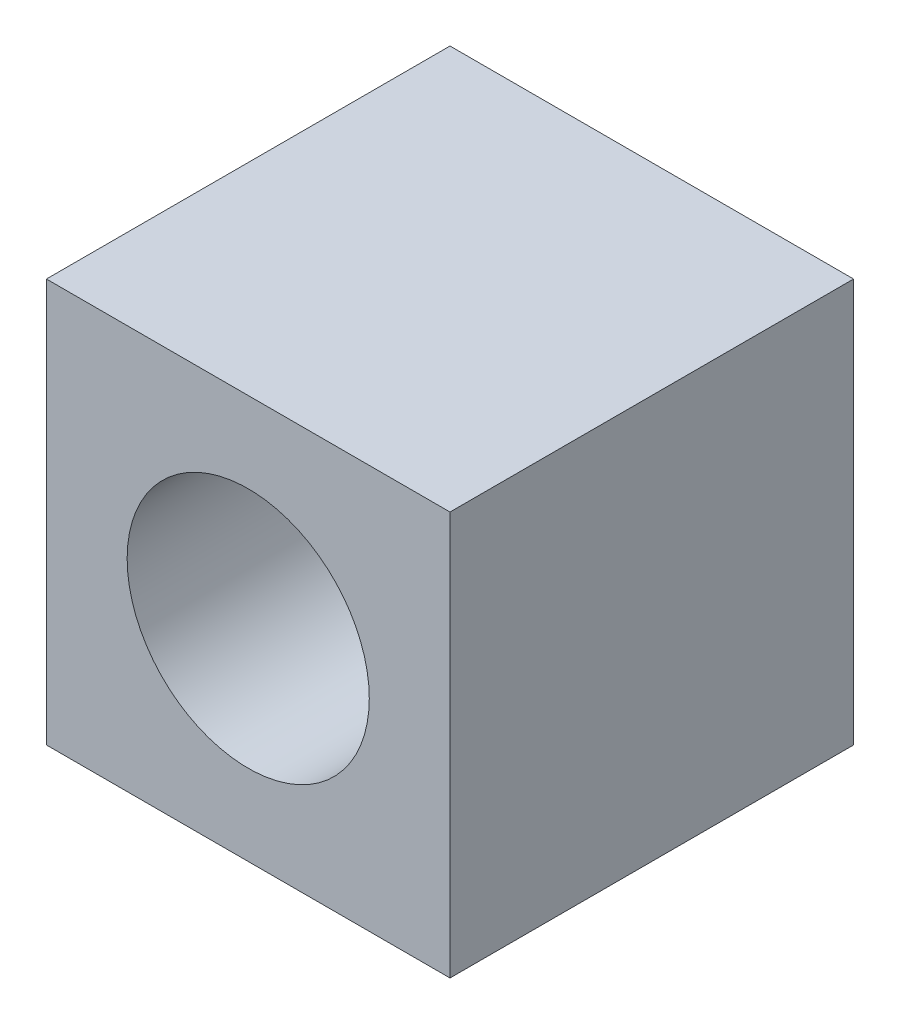
ISO-10303-21;
HEADER;
FILE_DESCRIPTION(('STEP AP214'),'2;1');
FILE_NAME('part.step','',(''),(''),'','','');
FILE_SCHEMA(('AUTOMOTIVE_DESIGN { 1 0 10303 214 1 1 1 1 }'));
ENDSEC;
DATA;
#1=APPLICATION_CONTEXT('core data for automotive mechanical design processes');
#2=APPLICATION_PROTOCOL_DEFINITION('international standard','automotive_design',2000,#1);
#3=PRODUCT_CONTEXT('',#1,'mechanical');
#4=PRODUCT('Part','Part','',(#3));
#5=PRODUCT_RELATED_PRODUCT_CATEGORY('part','',(#4));
#6=PRODUCT_DEFINITION_FORMATION('','',#4);
#7=PRODUCT_DEFINITION_CONTEXT('part definition',#1,'design');
#8=PRODUCT_DEFINITION('design','',#6,#7);
#9=PRODUCT_DEFINITION_SHAPE('','',#8);
#10=(LENGTH_UNIT() NAMED_UNIT(*) SI_UNIT(.MILLI.,.METRE.));
#11=(NAMED_UNIT(*) PLANE_ANGLE_UNIT() SI_UNIT($,.RADIAN.));
#12=(NAMED_UNIT(*) SI_UNIT($,.STERADIAN.) SOLID_ANGLE_UNIT());
#13=UNCERTAINTY_MEASURE_WITH_UNIT(LENGTH_MEASURE(1.E-05),#10,'distance_accuracy_value','');
#14=(GEOMETRIC_REPRESENTATION_CONTEXT(3) GLOBAL_UNCERTAINTY_ASSIGNED_CONTEXT((#13)) GLOBAL_UNIT_ASSIGNED_CONTEXT((#10,
#11,#12)) REPRESENTATION_CONTEXT('',''));
#15=CARTESIAN_POINT('',(0.,0.,0.));
#16=DIRECTION('',(0.,0.,1.));
#17=DIRECTION('',(1.,0.,0.));
#18=AXIS2_PLACEMENT_3D('',#15,#16,#17);
#19=CARTESIAN_POINT('',(0.,10.,0.));
#20=DIRECTION('',(0.,0.,-1.));
#21=DIRECTION('',(-1.,0.,0.));
#22=AXIS2_PLACEMENT_3D('',#19,#20,#21);
#23=PLANE('',#22);
#24=CARTESIAN_POINT('',(5.,5.,0.));
#25=DIRECTION('',(0.,0.,1.));
#26=DIRECTION('',(1.,0.,0.));
#27=AXIS2_PLACEMENT_3D('',#24,#25,#26);
#28=CIRCLE('',#27,3.);
#29=CARTESIAN_POINT('',(8.,5.,0.));
#30=VERTEX_POINT('',#29);
#31=EDGE_CURVE('E110',#30,#30,#28,.T.);
#32=ORIENTED_EDGE('',*,*,#31,.F.);
#33=EDGE_LOOP('',(#32));
#34=FACE_BOUND('',#33,.T.);
#35=DIRECTION('',(1.,0.,0.));
#36=VECTOR('',#35,1.);
#37=CARTESIAN_POINT('',(0.,0.,0.));
#38=LINE('',#37,#36);
#39=CARTESIAN_POINT('',(0.,0.,0.));
#40=VERTEX_POINT('',#39);
#41=CARTESIAN_POINT('',(10.,0.,0.));
#42=VERTEX_POINT('',#41);
#43=EDGE_CURVE('E96',#40,#42,#38,.T.);
#44=ORIENTED_EDGE('',*,*,#43,.T.);
#45=DIRECTION('',(0.,-1.,0.));
#46=VECTOR('',#45,1.);
#47=CARTESIAN_POINT('',(10.,10.,0.));
#48=LINE('',#47,#46);
#49=CARTESIAN_POINT('',(10.,10.,0.));
#50=VERTEX_POINT('',#49);
#51=EDGE_CURVE('E11',#50,#42,#48,.T.);
#52=ORIENTED_EDGE('',*,*,#51,.F.);
#53=DIRECTION('',(1.,0.,0.));
#54=VECTOR('',#53,1.);
#55=CARTESIAN_POINT('',(0.,10.,0.));
#56=LINE('',#55,#54);
#57=CARTESIAN_POINT('',(0.,10.,0.));
#58=VERTEX_POINT('',#57);
#59=EDGE_CURVE('E84',#58,#50,#56,.T.);
#60=ORIENTED_EDGE('',*,*,#59,.F.);
#61=DIRECTION('',(0.,-1.,0.));
#62=VECTOR('',#61,1.);
#63=CARTESIAN_POINT('',(0.,10.,0.));
#64=LINE('',#63,#62);
#65=EDGE_CURVE('E92',#58,#40,#64,.T.);
#66=ORIENTED_EDGE('',*,*,#65,.T.);
#67=EDGE_LOOP('',(#44,#52,#60,#66));
#68=FACE_BOUND('',#67,.T.);
#69=ADVANCED_FACE('F33',(#34,#68),#23,.F.);
#70=CARTESIAN_POINT('',(10.,10.,-10.));
#71=DIRECTION('',(-1.,0.,0.));
#72=DIRECTION('',(0.,0.,1.));
#73=AXIS2_PLACEMENT_3D('',#70,#71,#72);
#74=PLANE('',#73);
#75=DIRECTION('',(0.,0.,-1.));
#76=VECTOR('',#75,1.);
#77=CARTESIAN_POINT('',(10.,0.,-10.));
#78=LINE('',#77,#76);
#79=CARTESIAN_POINT('',(10.,0.,-10.));
#80=VERTEX_POINT('',#79);
#81=EDGE_CURVE('E88',#42,#80,#78,.T.);
#82=ORIENTED_EDGE('',*,*,#81,.T.);
#83=DIRECTION('',(0.,-1.,0.));
#84=VECTOR('',#83,1.);
#85=CARTESIAN_POINT('',(10.,10.,-10.));
#86=LINE('',#85,#84);
#87=CARTESIAN_POINT('',(10.,10.,-10.));
#88=VERTEX_POINT('',#87);
#89=EDGE_CURVE('E41',#88,#80,#86,.T.);
#90=ORIENTED_EDGE('',*,*,#89,.F.);
#91=DIRECTION('',(0.,0.,-1.));
#92=VECTOR('',#91,1.);
#93=CARTESIAN_POINT('',(10.,10.,-10.));
#94=LINE('',#93,#92);
#95=EDGE_CURVE('E79',#50,#88,#94,.T.);
#96=ORIENTED_EDGE('',*,*,#95,.F.);
#97=ORIENTED_EDGE('',*,*,#51,.T.);
#98=EDGE_LOOP('',(#82,#90,#96,#97));
#99=FACE_BOUND('',#98,.T.);
#100=ADVANCED_FACE('F87',(#99),#74,.F.);
#101=CARTESIAN_POINT('',(0.,10.,-10.));
#102=DIRECTION('',(0.,0.,1.));
#103=DIRECTION('',(1.,0.,0.));
#104=AXIS2_PLACEMENT_3D('',#101,#102,#103);
#105=PLANE('',#104);
#106=CARTESIAN_POINT('',(5.,5.,-10.));
#107=DIRECTION('',(0.,0.,1.));
#108=DIRECTION('',(1.,0.,0.));
#109=AXIS2_PLACEMENT_3D('',#106,#107,#108);
#110=CIRCLE('',#109,3.);
#111=CARTESIAN_POINT('',(8.,5.,-10.));
#112=VERTEX_POINT('',#111);
#113=EDGE_CURVE('E99',#112,#112,#110,.T.);
#114=ORIENTED_EDGE('',*,*,#113,.T.);
#115=EDGE_LOOP('',(#114));
#116=FACE_BOUND('',#115,.T.);
#117=DIRECTION('',(-1.,0.,0.));
#118=VECTOR('',#117,1.);
#119=CARTESIAN_POINT('',(0.,0.,-10.));
#120=LINE('',#119,#118);
#121=CARTESIAN_POINT('',(0.,0.,-10.));
#122=VERTEX_POINT('',#121);
#123=EDGE_CURVE('E66',#80,#122,#120,.T.);
#124=ORIENTED_EDGE('',*,*,#123,.T.);
#125=DIRECTION('',(0.,-1.,0.));
#126=VECTOR('',#125,1.);
#127=CARTESIAN_POINT('',(0.,10.,-10.));
#128=LINE('',#127,#126);
#129=CARTESIAN_POINT('',(0.,10.,-10.));
#130=VERTEX_POINT('',#129);
#131=EDGE_CURVE('E89',#130,#122,#128,.T.);
#132=ORIENTED_EDGE('',*,*,#131,.F.);
#133=DIRECTION('',(-1.,0.,0.));
#134=VECTOR('',#133,1.);
#135=CARTESIAN_POINT('',(0.,10.,-10.));
#136=LINE('',#135,#134);
#137=EDGE_CURVE('E82',#88,#130,#136,.T.);
#138=ORIENTED_EDGE('',*,*,#137,.F.);
#139=ORIENTED_EDGE('',*,*,#89,.T.);
#140=EDGE_LOOP('',(#124,#132,#138,#139));
#141=FACE_BOUND('',#140,.T.);
#142=ADVANCED_FACE('F90',(#116,#141),#105,.F.);
#143=CARTESIAN_POINT('',(0.,10.,0.));
#144=DIRECTION('',(1.,0.,0.));
#145=DIRECTION('',(0.,0.,-1.));
#146=AXIS2_PLACEMENT_3D('',#143,#144,#145);
#147=PLANE('',#146);
#148=DIRECTION('',(0.,0.,1.));
#149=VECTOR('',#148,1.);
#150=CARTESIAN_POINT('',(0.,0.,0.));
#151=LINE('',#150,#149);
#152=EDGE_CURVE('E72',#122,#40,#151,.T.);
#153=ORIENTED_EDGE('',*,*,#152,.T.);
#154=ORIENTED_EDGE('',*,*,#65,.F.);
#155=DIRECTION('',(0.,0.,1.));
#156=VECTOR('',#155,1.);
#157=CARTESIAN_POINT('',(0.,10.,0.));
#158=LINE('',#157,#156);
#159=EDGE_CURVE('E49',#130,#58,#158,.T.);
#160=ORIENTED_EDGE('',*,*,#159,.F.);
#161=ORIENTED_EDGE('',*,*,#131,.T.);
#162=EDGE_LOOP('',(#153,#154,#160,#161));
#163=FACE_BOUND('',#162,.T.);
#164=ADVANCED_FACE('F104',(#163),#147,.F.);
#165=CARTESIAN_POINT('',(0.,10.,0.));
#166=DIRECTION('',(0.,-1.,0.));
#167=DIRECTION('',(0.,0.,-1.));
#168=AXIS2_PLACEMENT_3D('',#165,#166,#167);
#169=PLANE('',#168);
#170=ORIENTED_EDGE('',*,*,#59,.T.);
#171=ORIENTED_EDGE('',*,*,#95,.T.);
#172=ORIENTED_EDGE('',*,*,#137,.T.);
#173=ORIENTED_EDGE('',*,*,#159,.T.);
#174=EDGE_LOOP('',(#170,#171,#172,#173));
#175=FACE_BOUND('',#174,.T.);
#176=ADVANCED_FACE('F80',(#175),#169,.F.);
#177=CARTESIAN_POINT('',(0.,0.,0.));
#178=DIRECTION('',(0.,-1.,0.));
#179=DIRECTION('',(0.,0.,-1.));
#180=AXIS2_PLACEMENT_3D('',#177,#178,#179);
#181=PLANE('',#180);
#182=ORIENTED_EDGE('',*,*,#43,.F.);
#183=ORIENTED_EDGE('',*,*,#152,.F.);
#184=ORIENTED_EDGE('',*,*,#123,.F.);
#185=ORIENTED_EDGE('',*,*,#81,.F.);
#186=EDGE_LOOP('',(#182,#183,#184,#185));
#187=FACE_BOUND('',#186,.T.);
#188=ADVANCED_FACE('F107',(#187),#181,.T.);
#189=CARTESIAN_POINT('',(5.,5.,-10.));
#190=DIRECTION('',(0.,0.,1.));
#191=DIRECTION('',(1.,0.,0.));
#192=AXIS2_PLACEMENT_3D('',#189,#190,#191);
#193=CYLINDRICAL_SURFACE('',#192,3.);
#194=ORIENTED_EDGE('',*,*,#113,.F.);
#195=EDGE_LOOP('',(#194));
#196=FACE_BOUND('',#195,.T.);
#197=ORIENTED_EDGE('',*,*,#31,.T.);
#198=EDGE_LOOP('',(#197));
#199=FACE_BOUND('',#198,.T.);
#200=ADVANCED_FACE('F117',(#196,#199),#193,.F.);
#201=CLOSED_SHELL('',(#69,#100,#142,#164,#176,#188,#200));
#202=MANIFOLD_SOLID_BREP('B2',#201);
#203=ADVANCED_BREP_SHAPE_REPRESENTATION('',(#18,#202),#14);
#204=SHAPE_DEFINITION_REPRESENTATION(#9,#203);
ENDSEC;
END-ISO-10303-21;
